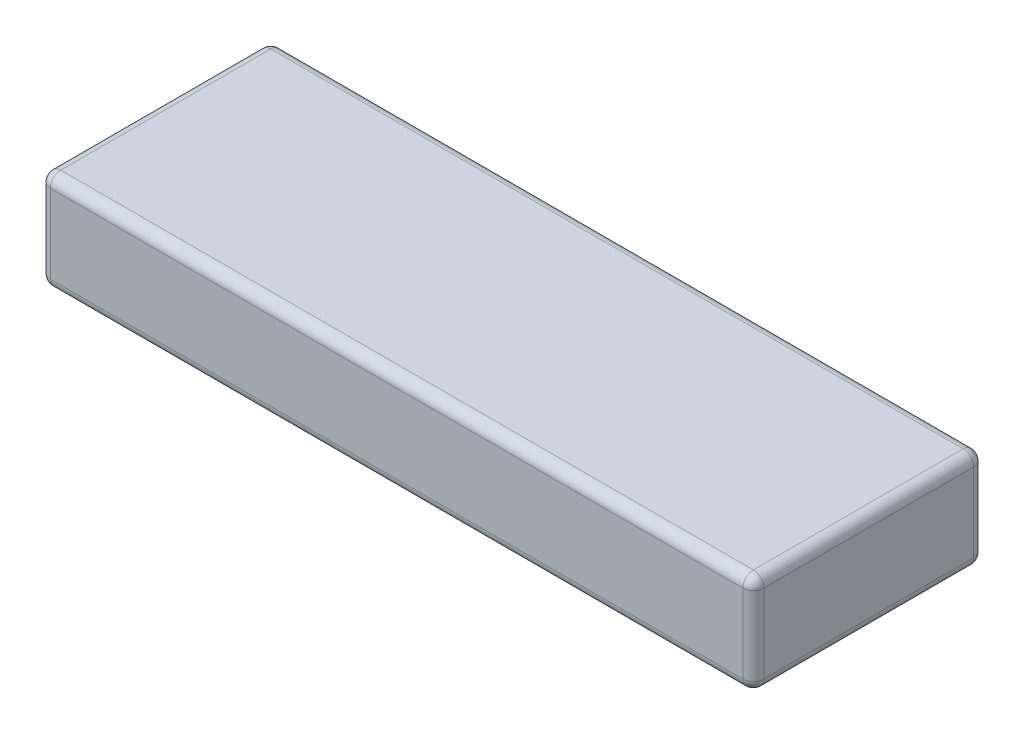
ISO-10303-21;
HEADER;
FILE_DESCRIPTION(('STEP AP214'),'2;1');
FILE_NAME('part.step','',(''),(''),'','','');
FILE_SCHEMA(('AUTOMOTIVE_DESIGN { 1 0 10303 214 1 1 1 1 }'));
ENDSEC;
DATA;
#1=APPLICATION_CONTEXT('core data for automotive mechanical design processes');
#2=APPLICATION_PROTOCOL_DEFINITION('international standard','automotive_design',2000,#1);
#3=PRODUCT_CONTEXT('',#1,'mechanical');
#4=PRODUCT('Part','Part','',(#3));
#5=PRODUCT_RELATED_PRODUCT_CATEGORY('part','',(#4));
#6=PRODUCT_DEFINITION_FORMATION('','',#4);
#7=PRODUCT_DEFINITION_CONTEXT('part definition',#1,'design');
#8=PRODUCT_DEFINITION('design','',#6,#7);
#9=PRODUCT_DEFINITION_SHAPE('','',#8);
#10=(LENGTH_UNIT() NAMED_UNIT(*) SI_UNIT(.MILLI.,.METRE.));
#11=(NAMED_UNIT(*) PLANE_ANGLE_UNIT() SI_UNIT($,.RADIAN.));
#12=(NAMED_UNIT(*) SI_UNIT($,.STERADIAN.) SOLID_ANGLE_UNIT());
#13=UNCERTAINTY_MEASURE_WITH_UNIT(LENGTH_MEASURE(1.E-05),#10,'distance_accuracy_value','');
#14=(GEOMETRIC_REPRESENTATION_CONTEXT(3) GLOBAL_UNCERTAINTY_ASSIGNED_CONTEXT((#13)) GLOBAL_UNIT_ASSIGNED_CONTEXT((#10,
#11,#12)) REPRESENTATION_CONTEXT('',''));
#15=CARTESIAN_POINT('',(0.,0.,0.));
#16=DIRECTION('',(0.,0.,1.));
#17=DIRECTION('',(1.,0.,0.));
#18=AXIS2_PLACEMENT_3D('',#15,#16,#17);
#19=CARTESIAN_POINT('',(68.,19.,22.));
#20=DIRECTION('',(-1.,0.,0.));
#21=DIRECTION('',(0.,0.,1.));
#22=AXIS2_PLACEMENT_3D('',#19,#20,#21);
#23=PLANE('',#22);
#24=DIRECTION('',(0.,-1.,0.));
#25=VECTOR('',#24,1.);
#26=CARTESIAN_POINT('',(68.,19.,-20.));
#27=LINE('',#26,#25);
#28=CARTESIAN_POINT('',(68.,2.,-20.));
#29=VERTEX_POINT('',#28);
#30=CARTESIAN_POINT('',(68.,17.,-20.));
#31=VERTEX_POINT('',#30);
#32=EDGE_CURVE('E201',#29,#31,#27,.F.);
#33=ORIENTED_EDGE('',*,*,#32,.T.);
#34=DIRECTION('',(0.,0.,-1.));
#35=VECTOR('',#34,1.);
#36=CARTESIAN_POINT('',(68.,17.,22.));
#37=LINE('',#36,#35);
#38=CARTESIAN_POINT('',(68.,17.,20.));
#39=VERTEX_POINT('',#38);
#40=EDGE_CURVE('E203',#31,#39,#37,.F.);
#41=ORIENTED_EDGE('',*,*,#40,.T.);
#42=DIRECTION('',(0.,-1.,0.));
#43=VECTOR('',#42,1.);
#44=CARTESIAN_POINT('',(68.,19.,20.));
#45=LINE('',#44,#43);
#46=CARTESIAN_POINT('',(68.,2.,20.));
#47=VERTEX_POINT('',#46);
#48=EDGE_CURVE('E197',#39,#47,#45,.T.);
#49=ORIENTED_EDGE('',*,*,#48,.T.);
#50=DIRECTION('',(0.,0.,-1.));
#51=VECTOR('',#50,1.);
#52=CARTESIAN_POINT('',(68.,2.,-22.));
#53=LINE('',#52,#51);
#54=EDGE_CURVE('E199',#47,#29,#53,.T.);
#55=ORIENTED_EDGE('',*,*,#54,.T.);
#56=EDGE_LOOP('',(#33,#41,#49,#55));
#57=FACE_BOUND('',#56,.T.);
#58=ADVANCED_FACE('F45',(#57),#23,.F.);
#59=CARTESIAN_POINT('',(-68.,19.,-22.));
#60=DIRECTION('',(0.,0.,1.));
#61=DIRECTION('',(1.,0.,0.));
#62=AXIS2_PLACEMENT_3D('',#59,#60,#61);
#63=PLANE('',#62);
#64=DIRECTION('',(0.,-1.,0.));
#65=VECTOR('',#64,1.);
#66=CARTESIAN_POINT('',(-66.,19.,-22.));
#67=LINE('',#66,#65);
#68=CARTESIAN_POINT('',(-66.,2.,-22.));
#69=VERTEX_POINT('',#68);
#70=CARTESIAN_POINT('',(-66.,17.,-22.));
#71=VERTEX_POINT('',#70);
#72=EDGE_CURVE('E192',#69,#71,#67,.F.);
#73=ORIENTED_EDGE('',*,*,#72,.T.);
#74=DIRECTION('',(-1.,0.,0.));
#75=VECTOR('',#74,1.);
#76=CARTESIAN_POINT('',(-68.,17.,-22.));
#77=LINE('',#76,#75);
#78=CARTESIAN_POINT('',(66.,17.,-22.));
#79=VERTEX_POINT('',#78);
#80=EDGE_CURVE('E194',#71,#79,#77,.F.);
#81=ORIENTED_EDGE('',*,*,#80,.T.);
#82=DIRECTION('',(0.,-1.,0.));
#83=VECTOR('',#82,1.);
#84=CARTESIAN_POINT('',(66.,19.,-22.));
#85=LINE('',#84,#83);
#86=CARTESIAN_POINT('',(66.,2.,-22.));
#87=VERTEX_POINT('',#86);
#88=EDGE_CURVE('E188',#79,#87,#85,.T.);
#89=ORIENTED_EDGE('',*,*,#88,.T.);
#90=DIRECTION('',(-1.,0.,0.));
#91=VECTOR('',#90,1.);
#92=CARTESIAN_POINT('',(-68.,2.,-22.));
#93=LINE('',#92,#91);
#94=EDGE_CURVE('E190',#87,#69,#93,.T.);
#95=ORIENTED_EDGE('',*,*,#94,.T.);
#96=EDGE_LOOP('',(#73,#81,#89,#95));
#97=FACE_BOUND('',#96,.T.);
#98=ADVANCED_FACE('F281',(#97),#63,.F.);
#99=CARTESIAN_POINT('',(-68.,19.,22.));
#100=DIRECTION('',(1.,0.,0.));
#101=DIRECTION('',(0.,0.,-1.));
#102=AXIS2_PLACEMENT_3D('',#99,#100,#101);
#103=PLANE('',#102);
#104=DIRECTION('',(0.,0.,1.));
#105=VECTOR('',#104,1.);
#106=CARTESIAN_POINT('',(-68.,17.,22.));
#107=LINE('',#106,#105);
#108=CARTESIAN_POINT('',(-68.,17.,20.));
#109=VERTEX_POINT('',#108);
#110=CARTESIAN_POINT('',(-68.,17.,-20.));
#111=VERTEX_POINT('',#110);
#112=EDGE_CURVE('E141',#109,#111,#107,.F.);
#113=ORIENTED_EDGE('',*,*,#112,.T.);
#114=DIRECTION('',(0.,-1.,0.));
#115=VECTOR('',#114,1.);
#116=CARTESIAN_POINT('',(-68.,19.,-20.));
#117=LINE('',#116,#115);
#118=CARTESIAN_POINT('',(-68.,2.,-20.));
#119=VERTEX_POINT('',#118);
#120=EDGE_CURVE('E177',#111,#119,#117,.T.);
#121=ORIENTED_EDGE('',*,*,#120,.T.);
#122=DIRECTION('',(0.,0.,1.));
#123=VECTOR('',#122,1.);
#124=CARTESIAN_POINT('',(-68.,2.,22.));
#125=LINE('',#124,#123);
#126=CARTESIAN_POINT('',(-68.,2.,20.));
#127=VERTEX_POINT('',#126);
#128=EDGE_CURVE('E170',#119,#127,#125,.T.);
#129=ORIENTED_EDGE('',*,*,#128,.T.);
#130=DIRECTION('',(0.,-1.,0.));
#131=VECTOR('',#130,1.);
#132=CARTESIAN_POINT('',(-68.,19.,20.));
#133=LINE('',#132,#131);
#134=EDGE_CURVE('E168',#127,#109,#133,.F.);
#135=ORIENTED_EDGE('',*,*,#134,.T.);
#136=EDGE_LOOP('',(#113,#121,#129,#135));
#137=FACE_BOUND('',#136,.T.);
#138=ADVANCED_FACE('F342',(#137),#103,.F.);
#139=CARTESIAN_POINT('',(-68.,19.,22.));
#140=DIRECTION('',(0.,0.,-1.));
#141=DIRECTION('',(-1.,0.,0.));
#142=AXIS2_PLACEMENT_3D('',#139,#140,#141);
#143=PLANE('',#142);
#144=DIRECTION('',(1.,0.,0.));
#145=VECTOR('',#144,1.);
#146=CARTESIAN_POINT('',(-68.,17.,22.));
#147=LINE('',#146,#145);
#148=CARTESIAN_POINT('',(66.,17.,22.));
#149=VERTEX_POINT('',#148);
#150=CARTESIAN_POINT('',(-66.,17.,22.));
#151=VERTEX_POINT('',#150);
#152=EDGE_CURVE('E54',#149,#151,#147,.F.);
#153=ORIENTED_EDGE('',*,*,#152,.T.);
#154=DIRECTION('',(0.,-1.,0.));
#155=VECTOR('',#154,1.);
#156=CARTESIAN_POINT('',(-66.,19.,22.));
#157=LINE('',#156,#155);
#158=CARTESIAN_POINT('',(-66.,2.,22.));
#159=VERTEX_POINT('',#158);
#160=EDGE_CURVE('E11',#151,#159,#157,.T.);
#161=ORIENTED_EDGE('',*,*,#160,.T.);
#162=DIRECTION('',(1.,0.,0.));
#163=VECTOR('',#162,1.);
#164=CARTESIAN_POINT('',(68.,2.,22.));
#165=LINE('',#164,#163);
#166=CARTESIAN_POINT('',(66.,2.,22.));
#167=VERTEX_POINT('',#166);
#168=EDGE_CURVE('E206',#159,#167,#165,.T.);
#169=ORIENTED_EDGE('',*,*,#168,.T.);
#170=DIRECTION('',(0.,-1.,0.));
#171=VECTOR('',#170,1.);
#172=CARTESIAN_POINT('',(66.,19.,22.));
#173=LINE('',#172,#171);
#174=EDGE_CURVE('E65',#167,#149,#173,.F.);
#175=ORIENTED_EDGE('',*,*,#174,.T.);
#176=EDGE_LOOP('',(#153,#161,#169,#175));
#177=FACE_BOUND('',#176,.T.);
#178=ADVANCED_FACE('F369',(#177),#143,.F.);
#179=CARTESIAN_POINT('',(0.,19.,0.));
#180=DIRECTION('',(0.,-1.,0.));
#181=DIRECTION('',(0.,0.,-1.));
#182=AXIS2_PLACEMENT_3D('',#179,#180,#181);
#183=PLANE('',#182);
#184=DIRECTION('',(-1.,0.,0.));
#185=VECTOR('',#184,1.);
#186=CARTESIAN_POINT('',(0.,19.,-20.));
#187=LINE('',#186,#185);
#188=CARTESIAN_POINT('',(66.,19.,-20.));
#189=VERTEX_POINT('',#188);
#190=CARTESIAN_POINT('',(-66.,19.,-20.));
#191=VERTEX_POINT('',#190);
#192=EDGE_CURVE('E166',#189,#191,#187,.T.);
#193=ORIENTED_EDGE('',*,*,#192,.T.);
#194=DIRECTION('',(0.,0.,1.));
#195=VECTOR('',#194,1.);
#196=CARTESIAN_POINT('',(-66.,19.,0.));
#197=LINE('',#196,#195);
#198=CARTESIAN_POINT('',(-66.,19.,20.));
#199=VERTEX_POINT('',#198);
#200=EDGE_CURVE('E139',#191,#199,#197,.T.);
#201=ORIENTED_EDGE('',*,*,#200,.T.);
#202=DIRECTION('',(1.,0.,0.));
#203=VECTOR('',#202,1.);
#204=CARTESIAN_POINT('',(0.,19.,20.));
#205=LINE('',#204,#203);
#206=CARTESIAN_POINT('',(66.,19.,20.));
#207=VERTEX_POINT('',#206);
#208=EDGE_CURVE('E156',#199,#207,#205,.T.);
#209=ORIENTED_EDGE('',*,*,#208,.T.);
#210=DIRECTION('',(0.,0.,-1.));
#211=VECTOR('',#210,1.);
#212=CARTESIAN_POINT('',(66.,19.,0.));
#213=LINE('',#212,#211);
#214=EDGE_CURVE('E162',#207,#189,#213,.T.);
#215=ORIENTED_EDGE('',*,*,#214,.T.);
#216=EDGE_LOOP('',(#193,#201,#209,#215));
#217=FACE_BOUND('',#216,.T.);
#218=ADVANCED_FACE('F164',(#217),#183,.F.);
#219=CARTESIAN_POINT('',(0.,0.,0.));
#220=DIRECTION('',(0.,-1.,0.));
#221=DIRECTION('',(0.,0.,-1.));
#222=AXIS2_PLACEMENT_3D('',#219,#220,#221);
#223=PLANE('',#222);
#224=DIRECTION('',(1.,0.,0.));
#225=VECTOR('',#224,1.);
#226=CARTESIAN_POINT('',(-68.,0.,20.));
#227=LINE('',#226,#225);
#228=CARTESIAN_POINT('',(66.,0.,20.));
#229=VERTEX_POINT('',#228);
#230=CARTESIAN_POINT('',(-66.,0.,20.));
#231=VERTEX_POINT('',#230);
#232=EDGE_CURVE('E179',#229,#231,#227,.F.);
#233=ORIENTED_EDGE('',*,*,#232,.T.);
#234=DIRECTION('',(0.,0.,1.));
#235=VECTOR('',#234,1.);
#236=CARTESIAN_POINT('',(-66.,0.,-22.));
#237=LINE('',#236,#235);
#238=CARTESIAN_POINT('',(-66.,0.,-20.));
#239=VERTEX_POINT('',#238);
#240=EDGE_CURVE('E185',#231,#239,#237,.F.);
#241=ORIENTED_EDGE('',*,*,#240,.T.);
#242=DIRECTION('',(-1.,0.,0.));
#243=VECTOR('',#242,1.);
#244=CARTESIAN_POINT('',(68.,0.,-20.));
#245=LINE('',#244,#243);
#246=CARTESIAN_POINT('',(66.,0.,-20.));
#247=VERTEX_POINT('',#246);
#248=EDGE_CURVE('E183',#239,#247,#245,.F.);
#249=ORIENTED_EDGE('',*,*,#248,.T.);
#250=DIRECTION('',(0.,0.,-1.));
#251=VECTOR('',#250,1.);
#252=CARTESIAN_POINT('',(66.,0.,22.));
#253=LINE('',#252,#251);
#254=EDGE_CURVE('E181',#247,#229,#253,.F.);
#255=ORIENTED_EDGE('',*,*,#254,.T.);
#256=EDGE_LOOP('',(#233,#241,#249,#255));
#257=FACE_BOUND('',#256,.T.);
#258=ADVANCED_FACE('F307',(#257),#223,.T.);
#259=CARTESIAN_POINT('',(66.,2.,22.));
#260=DIRECTION('',(0.,0.,1.));
#261=DIRECTION('',(1.,0.,0.));
#262=AXIS2_PLACEMENT_3D('',#259,#260,#261);
#263=CYLINDRICAL_SURFACE('',#262,2.);
#264=CARTESIAN_POINT('',(66.,2.,-20.));
#265=DIRECTION('',(0.,0.,-1.));
#266=DIRECTION('',(-1.,0.,0.));
#267=AXIS2_PLACEMENT_3D('',#264,#265,#266);
#268=CIRCLE('',#267,2.);
#269=EDGE_CURVE('E49',#29,#247,#268,.T.);
#270=ORIENTED_EDGE('',*,*,#269,.F.);
#271=ORIENTED_EDGE('',*,*,#54,.F.);
#272=CARTESIAN_POINT('',(66.,2.,20.));
#273=DIRECTION('',(0.,0.,1.));
#274=DIRECTION('',(1.,0.,0.));
#275=AXIS2_PLACEMENT_3D('',#272,#273,#274);
#276=CIRCLE('',#275,2.);
#277=EDGE_CURVE('E258',#229,#47,#276,.T.);
#278=ORIENTED_EDGE('',*,*,#277,.F.);
#279=ORIENTED_EDGE('',*,*,#254,.F.);
#280=EDGE_LOOP('',(#270,#271,#278,#279));
#281=FACE_BOUND('',#280,.T.);
#282=ADVANCED_FACE('F47',(#281),#263,.T.);
#283=CARTESIAN_POINT('',(66.,2.,-20.));
#284=DIRECTION('',(0.,-1.,0.));
#285=DIRECTION('',(0.,0.,-1.));
#286=AXIS2_PLACEMENT_3D('',#283,#284,#285);
#287=SPHERICAL_SURFACE('',#286,2.);
#288=CARTESIAN_POINT('',(66.,2.,-20.));
#289=DIRECTION('',(0.,-1.,0.));
#290=DIRECTION('',(0.,0.,-1.));
#291=AXIS2_PLACEMENT_3D('',#288,#289,#290);
#292=CIRCLE('',#291,2.);
#293=EDGE_CURVE('E253',#29,#87,#292,.F.);
#294=ORIENTED_EDGE('',*,*,#293,.F.);
#295=ORIENTED_EDGE('',*,*,#269,.T.);
#296=CARTESIAN_POINT('',(66.,2.,-20.));
#297=DIRECTION('',(1.,0.,0.));
#298=DIRECTION('',(0.,0.,-1.));
#299=AXIS2_PLACEMENT_3D('',#296,#297,#298);
#300=CIRCLE('',#299,2.);
#301=EDGE_CURVE('E256',#87,#247,#300,.F.);
#302=ORIENTED_EDGE('',*,*,#301,.F.);
#303=EDGE_LOOP('',(#294,#295,#302));
#304=FACE_BOUND('',#303,.T.);
#305=ADVANCED_FACE('F269',(#304),#287,.T.);
#306=CARTESIAN_POINT('',(66.,2.,20.));
#307=DIRECTION('',(1.,0.,0.));
#308=DIRECTION('',(0.,1.,0.));
#309=AXIS2_PLACEMENT_3D('',#306,#307,#308);
#310=SPHERICAL_SURFACE('',#309,2.);
#311=CARTESIAN_POINT('',(66.,2.,20.));
#312=DIRECTION('',(1.,0.,0.));
#313=DIRECTION('',(0.,0.,-1.));
#314=AXIS2_PLACEMENT_3D('',#311,#312,#313);
#315=CIRCLE('',#314,2.);
#316=EDGE_CURVE('E247',#229,#167,#315,.F.);
#317=ORIENTED_EDGE('',*,*,#316,.F.);
#318=ORIENTED_EDGE('',*,*,#277,.T.);
#319=CARTESIAN_POINT('',(66.,2.,20.));
#320=DIRECTION('',(0.,-1.,0.));
#321=DIRECTION('',(0.,0.,-1.));
#322=AXIS2_PLACEMENT_3D('',#319,#320,#321);
#323=CIRCLE('',#322,2.);
#324=EDGE_CURVE('E250',#167,#47,#323,.F.);
#325=ORIENTED_EDGE('',*,*,#324,.F.);
#326=EDGE_LOOP('',(#317,#318,#325));
#327=FACE_BOUND('',#326,.T.);
#328=ADVANCED_FACE('F300',(#327),#310,.T.);
#329=CARTESIAN_POINT('',(-68.,2.,-20.));
#330=DIRECTION('',(1.,0.,0.));
#331=DIRECTION('',(0.,0.,-1.));
#332=AXIS2_PLACEMENT_3D('',#329,#330,#331);
#333=CYLINDRICAL_SURFACE('',#332,2.);
#334=ORIENTED_EDGE('',*,*,#301,.T.);
#335=ORIENTED_EDGE('',*,*,#248,.F.);
#336=CARTESIAN_POINT('',(-66.,2.,-20.));
#337=DIRECTION('',(-1.,0.,0.));
#338=DIRECTION('',(0.,0.,1.));
#339=AXIS2_PLACEMENT_3D('',#336,#337,#338);
#340=CIRCLE('',#339,2.);
#341=EDGE_CURVE('E242',#69,#239,#340,.T.);
#342=ORIENTED_EDGE('',*,*,#341,.F.);
#343=ORIENTED_EDGE('',*,*,#94,.F.);
#344=EDGE_LOOP('',(#334,#335,#342,#343));
#345=FACE_BOUND('',#344,.T.);
#346=ADVANCED_FACE('F277',(#345),#333,.T.);
#347=CARTESIAN_POINT('',(66.,19.,-20.));
#348=DIRECTION('',(0.,-1.,0.));
#349=DIRECTION('',(0.,0.,-1.));
#350=AXIS2_PLACEMENT_3D('',#347,#348,#349);
#351=CYLINDRICAL_SURFACE('',#350,2.);
#352=ORIENTED_EDGE('',*,*,#293,.T.);
#353=ORIENTED_EDGE('',*,*,#88,.F.);
#354=CARTESIAN_POINT('',(66.,17.,-20.));
#355=DIRECTION('',(0.,1.,0.));
#356=DIRECTION('',(0.,0.,1.));
#357=AXIS2_PLACEMENT_3D('',#354,#355,#356);
#358=CIRCLE('',#357,2.);
#359=EDGE_CURVE('E239',#31,#79,#358,.T.);
#360=ORIENTED_EDGE('',*,*,#359,.F.);
#361=ORIENTED_EDGE('',*,*,#32,.F.);
#362=EDGE_LOOP('',(#352,#353,#360,#361));
#363=FACE_BOUND('',#362,.T.);
#364=ADVANCED_FACE('F287',(#363),#351,.T.);
#365=CARTESIAN_POINT('',(66.,17.,0.));
#366=DIRECTION('',(0.,0.,-1.));
#367=DIRECTION('',(-1.,0.,0.));
#368=AXIS2_PLACEMENT_3D('',#365,#366,#367);
#369=CYLINDRICAL_SURFACE('',#368,2.);
#370=CARTESIAN_POINT('',(66.,17.,20.));
#371=DIRECTION('',(0.,0.,1.));
#372=DIRECTION('',(1.,0.,0.));
#373=AXIS2_PLACEMENT_3D('',#370,#371,#372);
#374=CIRCLE('',#373,2.);
#375=EDGE_CURVE('E233',#39,#207,#374,.T.);
#376=ORIENTED_EDGE('',*,*,#375,.F.);
#377=ORIENTED_EDGE('',*,*,#40,.F.);
#378=CARTESIAN_POINT('',(66.,17.,-20.));
#379=DIRECTION('',(0.,0.,-1.));
#380=DIRECTION('',(-1.,0.,0.));
#381=AXIS2_PLACEMENT_3D('',#378,#379,#380);
#382=CIRCLE('',#381,2.);
#383=EDGE_CURVE('E236',#189,#31,#382,.T.);
#384=ORIENTED_EDGE('',*,*,#383,.F.);
#385=ORIENTED_EDGE('',*,*,#214,.F.);
#386=EDGE_LOOP('',(#376,#377,#384,#385));
#387=FACE_BOUND('',#386,.T.);
#388=ADVANCED_FACE('F293',(#387),#369,.T.);
#389=CARTESIAN_POINT('',(66.,19.,20.));
#390=DIRECTION('',(0.,-1.,0.));
#391=DIRECTION('',(0.,0.,-1.));
#392=AXIS2_PLACEMENT_3D('',#389,#390,#391);
#393=CYLINDRICAL_SURFACE('',#392,2.);
#394=ORIENTED_EDGE('',*,*,#324,.T.);
#395=ORIENTED_EDGE('',*,*,#48,.F.);
#396=CARTESIAN_POINT('',(66.,17.,20.));
#397=DIRECTION('',(0.,1.,0.));
#398=DIRECTION('',(0.,0.,1.));
#399=AXIS2_PLACEMENT_3D('',#396,#397,#398);
#400=CIRCLE('',#399,2.);
#401=EDGE_CURVE('E231',#149,#39,#400,.T.);
#402=ORIENTED_EDGE('',*,*,#401,.F.);
#403=ORIENTED_EDGE('',*,*,#174,.F.);
#404=EDGE_LOOP('',(#394,#395,#402,#403));
#405=FACE_BOUND('',#404,.T.);
#406=ADVANCED_FACE('F298',(#405),#393,.T.);
#407=CARTESIAN_POINT('',(-68.,2.,20.));
#408=DIRECTION('',(-1.,0.,0.));
#409=DIRECTION('',(0.,0.,1.));
#410=AXIS2_PLACEMENT_3D('',#407,#408,#409);
#411=CYLINDRICAL_SURFACE('',#410,2.);
#412=ORIENTED_EDGE('',*,*,#316,.T.);
#413=ORIENTED_EDGE('',*,*,#168,.F.);
#414=CARTESIAN_POINT('',(-66.,2.,20.));
#415=DIRECTION('',(-1.,0.,0.));
#416=DIRECTION('',(0.,0.,1.));
#417=AXIS2_PLACEMENT_3D('',#414,#415,#416);
#418=CIRCLE('',#417,2.);
#419=EDGE_CURVE('E228',#231,#159,#418,.T.);
#420=ORIENTED_EDGE('',*,*,#419,.F.);
#421=ORIENTED_EDGE('',*,*,#232,.F.);
#422=EDGE_LOOP('',(#412,#413,#420,#421));
#423=FACE_BOUND('',#422,.T.);
#424=ADVANCED_FACE('F304',(#423),#411,.T.);
#425=CARTESIAN_POINT('',(-66.,2.,22.));
#426=DIRECTION('',(0.,0.,-1.));
#427=DIRECTION('',(-1.,0.,0.));
#428=AXIS2_PLACEMENT_3D('',#425,#426,#427);
#429=CYLINDRICAL_SURFACE('',#428,2.);
#430=CARTESIAN_POINT('',(-66.,2.,-20.));
#431=DIRECTION('',(0.,0.,-1.));
#432=DIRECTION('',(-1.,0.,0.));
#433=AXIS2_PLACEMENT_3D('',#430,#431,#432);
#434=CIRCLE('',#433,2.);
#435=EDGE_CURVE('E244',#239,#119,#434,.T.);
#436=ORIENTED_EDGE('',*,*,#435,.F.);
#437=ORIENTED_EDGE('',*,*,#240,.F.);
#438=CARTESIAN_POINT('',(-66.,2.,20.));
#439=DIRECTION('',(0.,0.,1.));
#440=DIRECTION('',(1.,0.,0.));
#441=AXIS2_PLACEMENT_3D('',#438,#439,#440);
#442=CIRCLE('',#441,2.);
#443=EDGE_CURVE('E225',#127,#231,#442,.T.);
#444=ORIENTED_EDGE('',*,*,#443,.F.);
#445=ORIENTED_EDGE('',*,*,#128,.F.);
#446=EDGE_LOOP('',(#436,#437,#444,#445));
#447=FACE_BOUND('',#446,.T.);
#448=ADVANCED_FACE('F311',(#447),#429,.T.);
#449=CARTESIAN_POINT('',(-66.,2.,-20.));
#450=DIRECTION('',(0.,-1.,0.));
#451=DIRECTION('',(0.,0.,-1.));
#452=AXIS2_PLACEMENT_3D('',#449,#450,#451);
#453=SPHERICAL_SURFACE('',#452,2.);
#454=ORIENTED_EDGE('',*,*,#341,.T.);
#455=ORIENTED_EDGE('',*,*,#435,.T.);
#456=CARTESIAN_POINT('',(-66.,2.,-20.));
#457=DIRECTION('',(0.,-1.,0.));
#458=DIRECTION('',(0.,0.,-1.));
#459=AXIS2_PLACEMENT_3D('',#456,#457,#458);
#460=CIRCLE('',#459,2.);
#461=EDGE_CURVE('E222',#69,#119,#460,.F.);
#462=ORIENTED_EDGE('',*,*,#461,.F.);
#463=EDGE_LOOP('',(#454,#455,#462));
#464=FACE_BOUND('',#463,.T.);
#465=ADVANCED_FACE('F315',(#464),#453,.T.);
#466=CARTESIAN_POINT('',(66.,17.,-20.));
#467=DIRECTION('',(1.,0.,0.));
#468=DIRECTION('',(0.,0.,-1.));
#469=AXIS2_PLACEMENT_3D('',#466,#467,#468);
#470=SPHERICAL_SURFACE('',#469,2.);
#471=ORIENTED_EDGE('',*,*,#383,.T.);
#472=ORIENTED_EDGE('',*,*,#359,.T.);
#473=CARTESIAN_POINT('',(66.,17.,-20.));
#474=DIRECTION('',(1.,0.,0.));
#475=DIRECTION('',(0.,0.,-1.));
#476=AXIS2_PLACEMENT_3D('',#473,#474,#475);
#477=CIRCLE('',#476,2.);
#478=EDGE_CURVE('E220',#189,#79,#477,.F.);
#479=ORIENTED_EDGE('',*,*,#478,.F.);
#480=EDGE_LOOP('',(#471,#472,#479));
#481=FACE_BOUND('',#480,.T.);
#482=ADVANCED_FACE('F326',(#481),#470,.T.);
#483=CARTESIAN_POINT('',(66.,17.,20.));
#484=DIRECTION('',(1.,0.,0.));
#485=DIRECTION('',(0.,0.,-1.));
#486=AXIS2_PLACEMENT_3D('',#483,#484,#485);
#487=SPHERICAL_SURFACE('',#486,2.);
#488=ORIENTED_EDGE('',*,*,#401,.T.);
#489=ORIENTED_EDGE('',*,*,#375,.T.);
#490=CARTESIAN_POINT('',(66.,17.,20.));
#491=DIRECTION('',(1.,0.,0.));
#492=DIRECTION('',(0.,0.,-1.));
#493=AXIS2_PLACEMENT_3D('',#490,#491,#492);
#494=CIRCLE('',#493,2.);
#495=EDGE_CURVE('E159',#149,#207,#494,.F.);
#496=ORIENTED_EDGE('',*,*,#495,.F.);
#497=EDGE_LOOP('',(#488,#489,#496));
#498=FACE_BOUND('',#497,.T.);
#499=ADVANCED_FACE('F328',(#498),#487,.T.);
#500=CARTESIAN_POINT('',(-66.,2.,20.));
#501=DIRECTION('',(0.,-1.,0.));
#502=DIRECTION('',(0.,0.,-1.));
#503=AXIS2_PLACEMENT_3D('',#500,#501,#502);
#504=SPHERICAL_SURFACE('',#503,2.);
#505=ORIENTED_EDGE('',*,*,#443,.T.);
#506=ORIENTED_EDGE('',*,*,#419,.T.);
#507=CARTESIAN_POINT('',(-66.,2.,20.));
#508=DIRECTION('',(0.,-1.,0.));
#509=DIRECTION('',(0.,0.,-1.));
#510=AXIS2_PLACEMENT_3D('',#507,#508,#509);
#511=CIRCLE('',#510,2.);
#512=EDGE_CURVE('E217',#127,#159,#511,.F.);
#513=ORIENTED_EDGE('',*,*,#512,.F.);
#514=EDGE_LOOP('',(#505,#506,#513));
#515=FACE_BOUND('',#514,.T.);
#516=ADVANCED_FACE('F334',(#515),#504,.T.);
#517=CARTESIAN_POINT('',(-66.,19.,-20.));
#518=DIRECTION('',(0.,-1.,0.));
#519=DIRECTION('',(0.,0.,-1.));
#520=AXIS2_PLACEMENT_3D('',#517,#518,#519);
#521=CYLINDRICAL_SURFACE('',#520,2.);
#522=ORIENTED_EDGE('',*,*,#461,.T.);
#523=ORIENTED_EDGE('',*,*,#120,.F.);
#524=CARTESIAN_POINT('',(-66.,17.,-20.));
#525=DIRECTION('',(0.,1.,0.));
#526=DIRECTION('',(0.,0.,1.));
#527=AXIS2_PLACEMENT_3D('',#524,#525,#526);
#528=CIRCLE('',#527,2.);
#529=EDGE_CURVE('E214',#71,#111,#528,.T.);
#530=ORIENTED_EDGE('',*,*,#529,.F.);
#531=ORIENTED_EDGE('',*,*,#72,.F.);
#532=EDGE_LOOP('',(#522,#523,#530,#531));
#533=FACE_BOUND('',#532,.T.);
#534=ADVANCED_FACE('F318',(#533),#521,.T.);
#535=CARTESIAN_POINT('',(0.,17.,-20.));
#536=DIRECTION('',(-1.,0.,0.));
#537=DIRECTION('',(0.,0.,1.));
#538=AXIS2_PLACEMENT_3D('',#535,#536,#537);
#539=CYLINDRICAL_SURFACE('',#538,2.);
#540=ORIENTED_EDGE('',*,*,#478,.T.);
#541=ORIENTED_EDGE('',*,*,#80,.F.);
#542=CARTESIAN_POINT('',(-66.,17.,-20.));
#543=DIRECTION('',(-1.,0.,0.));
#544=DIRECTION('',(0.,0.,1.));
#545=AXIS2_PLACEMENT_3D('',#542,#543,#544);
#546=CIRCLE('',#545,2.);
#547=EDGE_CURVE('E153',#191,#71,#546,.T.);
#548=ORIENTED_EDGE('',*,*,#547,.F.);
#549=ORIENTED_EDGE('',*,*,#192,.F.);
#550=EDGE_LOOP('',(#540,#541,#548,#549));
#551=FACE_BOUND('',#550,.T.);
#552=ADVANCED_FACE('F324',(#551),#539,.T.);
#553=CARTESIAN_POINT('',(0.,17.,20.));
#554=DIRECTION('',(1.,0.,0.));
#555=DIRECTION('',(0.,0.,-1.));
#556=AXIS2_PLACEMENT_3D('',#553,#554,#555);
#557=CYLINDRICAL_SURFACE('',#556,2.);
#558=ORIENTED_EDGE('',*,*,#495,.T.);
#559=ORIENTED_EDGE('',*,*,#208,.F.);
#560=CARTESIAN_POINT('',(-66.,17.,20.));
#561=DIRECTION('',(-1.,0.,0.));
#562=DIRECTION('',(0.,0.,1.));
#563=AXIS2_PLACEMENT_3D('',#560,#561,#562);
#564=CIRCLE('',#563,2.);
#565=EDGE_CURVE('E147',#151,#199,#564,.T.);
#566=ORIENTED_EDGE('',*,*,#565,.F.);
#567=ORIENTED_EDGE('',*,*,#152,.F.);
#568=EDGE_LOOP('',(#558,#559,#566,#567));
#569=FACE_BOUND('',#568,.T.);
#570=ADVANCED_FACE('F157',(#569),#557,.T.);
#571=CARTESIAN_POINT('',(-66.,19.,20.));
#572=DIRECTION('',(0.,-1.,0.));
#573=DIRECTION('',(0.,0.,-1.));
#574=AXIS2_PLACEMENT_3D('',#571,#572,#573);
#575=CYLINDRICAL_SURFACE('',#574,2.);
#576=ORIENTED_EDGE('',*,*,#512,.T.);
#577=ORIENTED_EDGE('',*,*,#160,.F.);
#578=CARTESIAN_POINT('',(-66.,17.,20.));
#579=DIRECTION('',(0.,1.,0.));
#580=DIRECTION('',(0.,0.,1.));
#581=AXIS2_PLACEMENT_3D('',#578,#579,#580);
#582=CIRCLE('',#581,2.);
#583=EDGE_CURVE('E151',#109,#151,#582,.T.);
#584=ORIENTED_EDGE('',*,*,#583,.F.);
#585=ORIENTED_EDGE('',*,*,#134,.F.);
#586=EDGE_LOOP('',(#576,#577,#584,#585));
#587=FACE_BOUND('',#586,.T.);
#588=ADVANCED_FACE('F352',(#587),#575,.T.);
#589=CARTESIAN_POINT('',(-66.,17.,-20.));
#590=DIRECTION('',(0.,0.,-1.));
#591=DIRECTION('',(-1.,0.,0.));
#592=AXIS2_PLACEMENT_3D('',#589,#590,#591);
#593=SPHERICAL_SURFACE('',#592,2.);
#594=ORIENTED_EDGE('',*,*,#547,.T.);
#595=ORIENTED_EDGE('',*,*,#529,.T.);
#596=CARTESIAN_POINT('',(-66.,17.,-20.));
#597=DIRECTION('',(0.,0.,-1.));
#598=DIRECTION('',(-1.,0.,0.));
#599=AXIS2_PLACEMENT_3D('',#596,#597,#598);
#600=CIRCLE('',#599,2.);
#601=EDGE_CURVE('E144',#191,#111,#600,.F.);
#602=ORIENTED_EDGE('',*,*,#601,.F.);
#603=EDGE_LOOP('',(#594,#595,#602));
#604=FACE_BOUND('',#603,.T.);
#605=ADVANCED_FACE('F322',(#604),#593,.T.);
#606=CARTESIAN_POINT('',(-66.,17.,20.));
#607=DIRECTION('',(0.,0.,1.));
#608=DIRECTION('',(1.,0.,0.));
#609=AXIS2_PLACEMENT_3D('',#606,#607,#608);
#610=SPHERICAL_SURFACE('',#609,2.);
#611=ORIENTED_EDGE('',*,*,#583,.T.);
#612=ORIENTED_EDGE('',*,*,#565,.T.);
#613=CARTESIAN_POINT('',(-66.,17.,20.));
#614=DIRECTION('',(0.,0.,1.));
#615=DIRECTION('',(1.,0.,0.));
#616=AXIS2_PLACEMENT_3D('',#613,#614,#615);
#617=CIRCLE('',#616,2.);
#618=EDGE_CURVE('E135',#109,#199,#617,.F.);
#619=ORIENTED_EDGE('',*,*,#618,.F.);
#620=EDGE_LOOP('',(#611,#612,#619));
#621=FACE_BOUND('',#620,.T.);
#622=ADVANCED_FACE('F149',(#621),#610,.T.);
#623=CARTESIAN_POINT('',(-66.,17.,0.));
#624=DIRECTION('',(0.,0.,1.));
#625=DIRECTION('',(1.,0.,0.));
#626=AXIS2_PLACEMENT_3D('',#623,#624,#625);
#627=CYLINDRICAL_SURFACE('',#626,2.);
#628=ORIENTED_EDGE('',*,*,#601,.T.);
#629=ORIENTED_EDGE('',*,*,#112,.F.);
#630=ORIENTED_EDGE('',*,*,#618,.T.);
#631=ORIENTED_EDGE('',*,*,#200,.F.);
#632=EDGE_LOOP('',(#628,#629,#630,#631));
#633=FACE_BOUND('',#632,.T.);
#634=ADVANCED_FACE('F137',(#633),#627,.T.);
#635=CLOSED_SHELL('',(#58,#98,#138,#178,#218,#258,#282,#305,#328,#346,#364,#388,#406,#424,#448,
#465,#482,#499,#516,#534,#552,#570,#588,#605,#622,#634));
#636=MANIFOLD_SOLID_BREP('B2',#635);
#637=ADVANCED_BREP_SHAPE_REPRESENTATION('',(#18,#636),#14);
#638=SHAPE_DEFINITION_REPRESENTATION(#9,#637);
ENDSEC;
END-ISO-10303-21;
